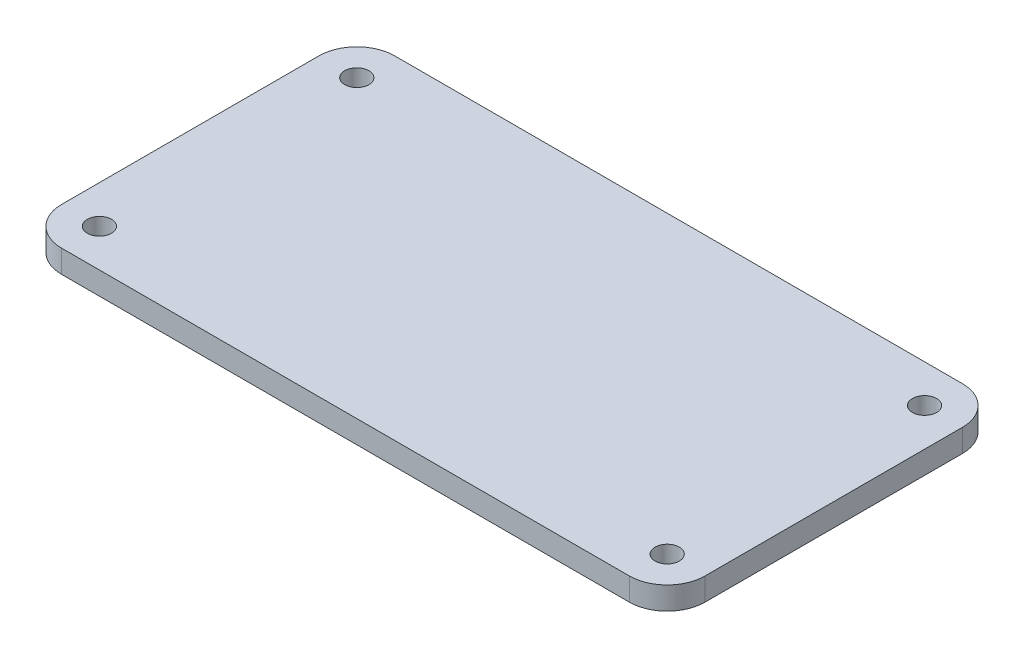
ISO-10303-21;
HEADER;
FILE_DESCRIPTION(('STEP AP214'),'2;1');
FILE_NAME('part.step','',(''),(''),'','','');
FILE_SCHEMA(('AUTOMOTIVE_DESIGN { 1 0 10303 214 1 1 1 1 }'));
ENDSEC;
DATA;
#1=APPLICATION_CONTEXT('core data for automotive mechanical design processes');
#2=APPLICATION_PROTOCOL_DEFINITION('international standard','automotive_design',2000,#1);
#3=PRODUCT_CONTEXT('',#1,'mechanical');
#4=PRODUCT('Part','Part','',(#3));
#5=PRODUCT_RELATED_PRODUCT_CATEGORY('part','',(#4));
#6=PRODUCT_DEFINITION_FORMATION('','',#4);
#7=PRODUCT_DEFINITION_CONTEXT('part definition',#1,'design');
#8=PRODUCT_DEFINITION('design','',#6,#7);
#9=PRODUCT_DEFINITION_SHAPE('','',#8);
#10=(LENGTH_UNIT() NAMED_UNIT(*) SI_UNIT(.MILLI.,.METRE.));
#11=(NAMED_UNIT(*) PLANE_ANGLE_UNIT() SI_UNIT($,.RADIAN.));
#12=(NAMED_UNIT(*) SI_UNIT($,.STERADIAN.) SOLID_ANGLE_UNIT());
#13=UNCERTAINTY_MEASURE_WITH_UNIT(LENGTH_MEASURE(1.E-05),#10,'distance_accuracy_value','');
#14=(GEOMETRIC_REPRESENTATION_CONTEXT(3) GLOBAL_UNCERTAINTY_ASSIGNED_CONTEXT((#13)) GLOBAL_UNIT_ASSIGNED_CONTEXT((#10,
#11,#12)) REPRESENTATION_CONTEXT('',''));
#15=CARTESIAN_POINT('',(0.,0.,0.));
#16=DIRECTION('',(0.,0.,1.));
#17=DIRECTION('',(1.,0.,0.));
#18=AXIS2_PLACEMENT_3D('',#15,#16,#17);
#19=CARTESIAN_POINT('',(-42.5,3.,22.));
#20=DIRECTION('',(1.,0.,0.));
#21=DIRECTION('',(0.,0.,-1.));
#22=AXIS2_PLACEMENT_3D('',#19,#20,#21);
#23=PLANE('',#22);
#24=DIRECTION('',(0.,0.,1.));
#25=VECTOR('',#24,1.);
#26=CARTESIAN_POINT('',(-42.5,0.,22.));
#27=LINE('',#26,#25);
#28=CARTESIAN_POINT('',(-42.5,0.,-17.));
#29=VERTEX_POINT('',#28);
#30=CARTESIAN_POINT('',(-42.5,0.,17.));
#31=VERTEX_POINT('',#30);
#32=EDGE_CURVE('E186',#29,#31,#27,.T.);
#33=ORIENTED_EDGE('',*,*,#32,.T.);
#34=DIRECTION('',(0.,-1.,0.));
#35=VECTOR('',#34,1.);
#36=CARTESIAN_POINT('',(-42.5,3.,17.));
#37=LINE('',#36,#35);
#38=CARTESIAN_POINT('',(-42.5,3.,17.));
#39=VERTEX_POINT('',#38);
#40=EDGE_CURVE('E11',#31,#39,#37,.F.);
#41=ORIENTED_EDGE('',*,*,#40,.T.);
#42=DIRECTION('',(0.,0.,1.));
#43=VECTOR('',#42,1.);
#44=CARTESIAN_POINT('',(-42.5,3.,22.));
#45=LINE('',#44,#43);
#46=CARTESIAN_POINT('',(-42.5,3.,-17.));
#47=VERTEX_POINT('',#46);
#48=EDGE_CURVE('E139',#47,#39,#45,.T.);
#49=ORIENTED_EDGE('',*,*,#48,.F.);
#50=DIRECTION('',(0.,-1.,0.));
#51=VECTOR('',#50,1.);
#52=CARTESIAN_POINT('',(-42.5,3.,-17.));
#53=LINE('',#52,#51);
#54=EDGE_CURVE('E52',#47,#29,#53,.T.);
#55=ORIENTED_EDGE('',*,*,#54,.T.);
#56=EDGE_LOOP('',(#33,#41,#49,#55));
#57=FACE_BOUND('',#56,.T.);
#58=ADVANCED_FACE('F43',(#57),#23,.F.);
#59=CARTESIAN_POINT('',(42.5,3.,22.));
#60=DIRECTION('',(0.,0.,-1.));
#61=DIRECTION('',(-1.,0.,0.));
#62=AXIS2_PLACEMENT_3D('',#59,#60,#61);
#63=PLANE('',#62);
#64=DIRECTION('',(1.,0.,0.));
#65=VECTOR('',#64,1.);
#66=CARTESIAN_POINT('',(42.5,0.,22.));
#67=LINE('',#66,#65);
#68=CARTESIAN_POINT('',(-37.5,0.,22.));
#69=VERTEX_POINT('',#68);
#70=CARTESIAN_POINT('',(37.5,0.,22.));
#71=VERTEX_POINT('',#70);
#72=EDGE_CURVE('E146',#69,#71,#67,.T.);
#73=ORIENTED_EDGE('',*,*,#72,.T.);
#74=DIRECTION('',(0.,-1.,0.));
#75=VECTOR('',#74,1.);
#76=CARTESIAN_POINT('',(37.5,3.,22.));
#77=LINE('',#76,#75);
#78=CARTESIAN_POINT('',(37.5,3.,22.));
#79=VERTEX_POINT('',#78);
#80=EDGE_CURVE('E59',#71,#79,#77,.F.);
#81=ORIENTED_EDGE('',*,*,#80,.T.);
#82=DIRECTION('',(1.,0.,0.));
#83=VECTOR('',#82,1.);
#84=CARTESIAN_POINT('',(42.5,3.,22.));
#85=LINE('',#84,#83);
#86=CARTESIAN_POINT('',(-37.5,3.,22.));
#87=VERTEX_POINT('',#86);
#88=EDGE_CURVE('E144',#87,#79,#85,.T.);
#89=ORIENTED_EDGE('',*,*,#88,.F.);
#90=DIRECTION('',(0.,-1.,0.));
#91=VECTOR('',#90,1.);
#92=CARTESIAN_POINT('',(-37.5,3.,22.));
#93=LINE('',#92,#91);
#94=EDGE_CURVE('E175',#87,#69,#93,.T.);
#95=ORIENTED_EDGE('',*,*,#94,.T.);
#96=EDGE_LOOP('',(#73,#81,#89,#95));
#97=FACE_BOUND('',#96,.T.);
#98=ADVANCED_FACE('F251',(#97),#63,.F.);
#99=CARTESIAN_POINT('',(42.5,3.,22.));
#100=DIRECTION('',(-1.,0.,0.));
#101=DIRECTION('',(0.,0.,1.));
#102=AXIS2_PLACEMENT_3D('',#99,#100,#101);
#103=PLANE('',#102);
#104=DIRECTION('',(0.,0.,-1.));
#105=VECTOR('',#104,1.);
#106=CARTESIAN_POINT('',(42.5,0.,22.));
#107=LINE('',#106,#105);
#108=CARTESIAN_POINT('',(42.5,0.,17.));
#109=VERTEX_POINT('',#108);
#110=CARTESIAN_POINT('',(42.5,0.,-17.));
#111=VERTEX_POINT('',#110);
#112=EDGE_CURVE('E140',#109,#111,#107,.T.);
#113=ORIENTED_EDGE('',*,*,#112,.T.);
#114=DIRECTION('',(0.,-1.,0.));
#115=VECTOR('',#114,1.);
#116=CARTESIAN_POINT('',(42.5,3.,-17.));
#117=LINE('',#116,#115);
#118=CARTESIAN_POINT('',(42.5,3.,-17.));
#119=VERTEX_POINT('',#118);
#120=EDGE_CURVE('E115',#111,#119,#117,.F.);
#121=ORIENTED_EDGE('',*,*,#120,.T.);
#122=DIRECTION('',(0.,0.,-1.));
#123=VECTOR('',#122,1.);
#124=CARTESIAN_POINT('',(42.5,3.,22.));
#125=LINE('',#124,#123);
#126=CARTESIAN_POINT('',(42.5,3.,17.));
#127=VERTEX_POINT('',#126);
#128=EDGE_CURVE('E202',#127,#119,#125,.T.);
#129=ORIENTED_EDGE('',*,*,#128,.F.);
#130=DIRECTION('',(0.,-1.,0.));
#131=VECTOR('',#130,1.);
#132=CARTESIAN_POINT('',(42.5,3.,17.));
#133=LINE('',#132,#131);
#134=EDGE_CURVE('E121',#127,#109,#133,.T.);
#135=ORIENTED_EDGE('',*,*,#134,.T.);
#136=EDGE_LOOP('',(#113,#121,#129,#135));
#137=FACE_BOUND('',#136,.T.);
#138=ADVANCED_FACE('F248',(#137),#103,.F.);
#139=CARTESIAN_POINT('',(42.5,3.,-22.));
#140=DIRECTION('',(0.,0.,1.));
#141=DIRECTION('',(1.,0.,0.));
#142=AXIS2_PLACEMENT_3D('',#139,#140,#141);
#143=PLANE('',#142);
#144=DIRECTION('',(-1.,0.,0.));
#145=VECTOR('',#144,1.);
#146=CARTESIAN_POINT('',(42.5,3.,-22.));
#147=LINE('',#146,#145);
#148=CARTESIAN_POINT('',(37.5,3.,-22.));
#149=VERTEX_POINT('',#148);
#150=CARTESIAN_POINT('',(-37.5,3.,-22.));
#151=VERTEX_POINT('',#150);
#152=EDGE_CURVE('E131',#149,#151,#147,.T.);
#153=ORIENTED_EDGE('',*,*,#152,.F.);
#154=DIRECTION('',(0.,-1.,0.));
#155=VECTOR('',#154,1.);
#156=CARTESIAN_POINT('',(37.5,3.,-22.));
#157=LINE('',#156,#155);
#158=CARTESIAN_POINT('',(37.5,0.,-22.));
#159=VERTEX_POINT('',#158);
#160=EDGE_CURVE('E114',#149,#159,#157,.T.);
#161=ORIENTED_EDGE('',*,*,#160,.T.);
#162=DIRECTION('',(-1.,0.,0.));
#163=VECTOR('',#162,1.);
#164=CARTESIAN_POINT('',(42.5,0.,-22.));
#165=LINE('',#164,#163);
#166=CARTESIAN_POINT('',(-37.5,0.,-22.));
#167=VERTEX_POINT('',#166);
#168=EDGE_CURVE('E128',#159,#167,#165,.T.);
#169=ORIENTED_EDGE('',*,*,#168,.T.);
#170=DIRECTION('',(0.,-1.,0.));
#171=VECTOR('',#170,1.);
#172=CARTESIAN_POINT('',(-37.5,3.,-22.));
#173=LINE('',#172,#171);
#174=EDGE_CURVE('E134',#167,#151,#173,.F.);
#175=ORIENTED_EDGE('',*,*,#174,.T.);
#176=EDGE_LOOP('',(#153,#161,#169,#175));
#177=FACE_BOUND('',#176,.T.);
#178=ADVANCED_FACE('F127',(#177),#143,.F.);
#179=CARTESIAN_POINT('',(0.,3.,0.));
#180=DIRECTION('',(0.,1.,0.));
#181=DIRECTION('',(0.,0.,1.));
#182=AXIS2_PLACEMENT_3D('',#179,#180,#181);
#183=PLANE('',#182);
#184=CARTESIAN_POINT('',(-37.5,3.,17.));
#185=DIRECTION('',(0.,1.,0.));
#186=DIRECTION('',(0.,0.,1.));
#187=AXIS2_PLACEMENT_3D('',#184,#185,#186);
#188=CIRCLE('',#187,1.6);
#189=CARTESIAN_POINT('',(-37.5,3.,18.6));
#190=VERTEX_POINT('',#189);
#191=EDGE_CURVE('E210',#190,#190,#188,.T.);
#192=ORIENTED_EDGE('',*,*,#191,.F.);
#193=EDGE_LOOP('',(#192));
#194=FACE_BOUND('',#193,.T.);
#195=CARTESIAN_POINT('',(37.5,3.,-17.));
#196=DIRECTION('',(0.,1.,0.));
#197=DIRECTION('',(0.,0.,1.));
#198=AXIS2_PLACEMENT_3D('',#195,#196,#197);
#199=CIRCLE('',#198,1.6);
#200=CARTESIAN_POINT('',(37.5,3.,-15.4));
#201=VERTEX_POINT('',#200);
#202=EDGE_CURVE('E216',#201,#201,#199,.T.);
#203=ORIENTED_EDGE('',*,*,#202,.F.);
#204=EDGE_LOOP('',(#203));
#205=FACE_BOUND('',#204,.T.);
#206=CARTESIAN_POINT('',(37.5,3.,17.));
#207=DIRECTION('',(0.,1.,0.));
#208=DIRECTION('',(0.,0.,1.));
#209=AXIS2_PLACEMENT_3D('',#206,#207,#208);
#210=CIRCLE('',#209,1.6);
#211=CARTESIAN_POINT('',(37.5,3.,18.6));
#212=VERTEX_POINT('',#211);
#213=EDGE_CURVE('E217',#212,#212,#210,.T.);
#214=ORIENTED_EDGE('',*,*,#213,.F.);
#215=EDGE_LOOP('',(#214));
#216=FACE_BOUND('',#215,.T.);
#217=CARTESIAN_POINT('',(-37.5,3.,-17.));
#218=DIRECTION('',(0.,1.,0.));
#219=DIRECTION('',(0.,0.,1.));
#220=AXIS2_PLACEMENT_3D('',#217,#218,#219);
#221=CIRCLE('',#220,1.6);
#222=CARTESIAN_POINT('',(-37.5,3.,-15.4));
#223=VERTEX_POINT('',#222);
#224=EDGE_CURVE('E197',#223,#223,#221,.T.);
#225=ORIENTED_EDGE('',*,*,#224,.F.);
#226=EDGE_LOOP('',(#225));
#227=FACE_BOUND('',#226,.T.);
#228=ORIENTED_EDGE('',*,*,#128,.T.);
#229=CARTESIAN_POINT('',(37.5,3.,-17.));
#230=DIRECTION('',(0.,1.,0.));
#231=DIRECTION('',(0.,0.,1.));
#232=AXIS2_PLACEMENT_3D('',#229,#230,#231);
#233=CIRCLE('',#232,5.);
#234=EDGE_CURVE('E172',#119,#149,#233,.T.);
#235=ORIENTED_EDGE('',*,*,#234,.T.);
#236=ORIENTED_EDGE('',*,*,#152,.T.);
#237=CARTESIAN_POINT('',(-37.5,3.,-17.));
#238=DIRECTION('',(0.,1.,0.));
#239=DIRECTION('',(0.,0.,1.));
#240=AXIS2_PLACEMENT_3D('',#237,#238,#239);
#241=CIRCLE('',#240,5.);
#242=EDGE_CURVE('E164',#151,#47,#241,.T.);
#243=ORIENTED_EDGE('',*,*,#242,.T.);
#244=ORIENTED_EDGE('',*,*,#48,.T.);
#245=CARTESIAN_POINT('',(-37.5,3.,17.));
#246=DIRECTION('',(0.,1.,0.));
#247=DIRECTION('',(0.,0.,1.));
#248=AXIS2_PLACEMENT_3D('',#245,#246,#247);
#249=CIRCLE('',#248,5.);
#250=EDGE_CURVE('E66',#39,#87,#249,.T.);
#251=ORIENTED_EDGE('',*,*,#250,.T.);
#252=ORIENTED_EDGE('',*,*,#88,.T.);
#253=CARTESIAN_POINT('',(37.5,3.,17.));
#254=DIRECTION('',(0.,1.,0.));
#255=DIRECTION('',(0.,0.,1.));
#256=AXIS2_PLACEMENT_3D('',#253,#254,#255);
#257=CIRCLE('',#256,5.);
#258=EDGE_CURVE('E169',#79,#127,#257,.T.);
#259=ORIENTED_EDGE('',*,*,#258,.T.);
#260=EDGE_LOOP('',(#228,#235,#236,#243,#244,#251,#252,#259));
#261=FACE_BOUND('',#260,.T.);
#262=ADVANCED_FACE('F238',(#194,#205,#216,#227,#261),#183,.T.);
#263=CARTESIAN_POINT('',(0.,0.,0.));
#264=DIRECTION('',(0.,1.,0.));
#265=DIRECTION('',(0.,0.,1.));
#266=AXIS2_PLACEMENT_3D('',#263,#264,#265);
#267=PLANE('',#266);
#268=CARTESIAN_POINT('',(-37.5,0.,17.));
#269=DIRECTION('',(0.,1.,0.));
#270=DIRECTION('',(0.,0.,1.));
#271=AXIS2_PLACEMENT_3D('',#268,#269,#270);
#272=CIRCLE('',#271,1.6);
#273=CARTESIAN_POINT('',(-37.5,0.,18.6));
#274=VERTEX_POINT('',#273);
#275=EDGE_CURVE('E221',#274,#274,#272,.T.);
#276=ORIENTED_EDGE('',*,*,#275,.T.);
#277=EDGE_LOOP('',(#276));
#278=FACE_BOUND('',#277,.T.);
#279=CARTESIAN_POINT('',(37.5,0.,-17.));
#280=DIRECTION('',(0.,1.,0.));
#281=DIRECTION('',(0.,0.,1.));
#282=AXIS2_PLACEMENT_3D('',#279,#280,#281);
#283=CIRCLE('',#282,1.6);
#284=CARTESIAN_POINT('',(37.5,0.,-15.4));
#285=VERTEX_POINT('',#284);
#286=EDGE_CURVE('E212',#285,#285,#283,.T.);
#287=ORIENTED_EDGE('',*,*,#286,.T.);
#288=EDGE_LOOP('',(#287));
#289=FACE_BOUND('',#288,.T.);
#290=CARTESIAN_POINT('',(37.5,0.,17.));
#291=DIRECTION('',(0.,1.,0.));
#292=DIRECTION('',(0.,0.,1.));
#293=AXIS2_PLACEMENT_3D('',#290,#291,#292);
#294=CIRCLE('',#293,1.6);
#295=CARTESIAN_POINT('',(37.5,0.,18.6));
#296=VERTEX_POINT('',#295);
#297=EDGE_CURVE('E228',#296,#296,#294,.T.);
#298=ORIENTED_EDGE('',*,*,#297,.T.);
#299=EDGE_LOOP('',(#298));
#300=FACE_BOUND('',#299,.T.);
#301=CARTESIAN_POINT('',(-37.5,0.,-17.));
#302=DIRECTION('',(0.,1.,0.));
#303=DIRECTION('',(0.,0.,1.));
#304=AXIS2_PLACEMENT_3D('',#301,#302,#303);
#305=CIRCLE('',#304,1.6);
#306=CARTESIAN_POINT('',(-37.5,0.,-15.4));
#307=VERTEX_POINT('',#306);
#308=EDGE_CURVE('E192',#307,#307,#305,.T.);
#309=ORIENTED_EDGE('',*,*,#308,.T.);
#310=EDGE_LOOP('',(#309));
#311=FACE_BOUND('',#310,.T.);
#312=ORIENTED_EDGE('',*,*,#168,.F.);
#313=CARTESIAN_POINT('',(37.5,0.,-17.));
#314=DIRECTION('',(0.,1.,0.));
#315=DIRECTION('',(0.,0.,1.));
#316=AXIS2_PLACEMENT_3D('',#313,#314,#315);
#317=CIRCLE('',#316,5.);
#318=EDGE_CURVE('E110',#159,#111,#317,.F.);
#319=ORIENTED_EDGE('',*,*,#318,.T.);
#320=ORIENTED_EDGE('',*,*,#112,.F.);
#321=CARTESIAN_POINT('',(37.5,0.,17.));
#322=DIRECTION('',(0.,1.,0.));
#323=DIRECTION('',(0.,0.,1.));
#324=AXIS2_PLACEMENT_3D('',#321,#322,#323);
#325=CIRCLE('',#324,5.);
#326=EDGE_CURVE('E122',#109,#71,#325,.F.);
#327=ORIENTED_EDGE('',*,*,#326,.T.);
#328=ORIENTED_EDGE('',*,*,#72,.F.);
#329=CARTESIAN_POINT('',(-37.5,0.,17.));
#330=DIRECTION('',(0.,1.,0.));
#331=DIRECTION('',(0.,0.,1.));
#332=AXIS2_PLACEMENT_3D('',#329,#330,#331);
#333=CIRCLE('',#332,5.);
#334=EDGE_CURVE('E154',#69,#31,#333,.F.);
#335=ORIENTED_EDGE('',*,*,#334,.T.);
#336=ORIENTED_EDGE('',*,*,#32,.F.);
#337=CARTESIAN_POINT('',(-37.5,0.,-17.));
#338=DIRECTION('',(0.,1.,0.));
#339=DIRECTION('',(0.,0.,1.));
#340=AXIS2_PLACEMENT_3D('',#337,#338,#339);
#341=CIRCLE('',#340,5.);
#342=EDGE_CURVE('E133',#29,#167,#341,.F.);
#343=ORIENTED_EDGE('',*,*,#342,.T.);
#344=EDGE_LOOP('',(#312,#319,#320,#327,#328,#335,#336,#343));
#345=FACE_BOUND('',#344,.T.);
#346=ADVANCED_FACE('F136',(#278,#289,#300,#311,#345),#267,.F.);
#347=CARTESIAN_POINT('',(-37.5,0.,-17.));
#348=DIRECTION('',(0.,1.,0.));
#349=DIRECTION('',(0.,0.,1.));
#350=AXIS2_PLACEMENT_3D('',#347,#348,#349);
#351=CYLINDRICAL_SURFACE('',#350,1.6);
#352=ORIENTED_EDGE('',*,*,#308,.F.);
#353=EDGE_LOOP('',(#352));
#354=FACE_BOUND('',#353,.T.);
#355=ORIENTED_EDGE('',*,*,#224,.T.);
#356=EDGE_LOOP('',(#355));
#357=FACE_BOUND('',#356,.T.);
#358=ADVANCED_FACE('F324',(#354,#357),#351,.F.);
#359=CARTESIAN_POINT('',(37.5,0.,17.));
#360=DIRECTION('',(0.,1.,0.));
#361=DIRECTION('',(0.,0.,1.));
#362=AXIS2_PLACEMENT_3D('',#359,#360,#361);
#363=CYLINDRICAL_SURFACE('',#362,1.6);
#364=ORIENTED_EDGE('',*,*,#297,.F.);
#365=EDGE_LOOP('',(#364));
#366=FACE_BOUND('',#365,.T.);
#367=ORIENTED_EDGE('',*,*,#213,.T.);
#368=EDGE_LOOP('',(#367));
#369=FACE_BOUND('',#368,.T.);
#370=ADVANCED_FACE('F236',(#366,#369),#363,.F.);
#371=CARTESIAN_POINT('',(37.5,0.,-17.));
#372=DIRECTION('',(0.,1.,0.));
#373=DIRECTION('',(0.,0.,1.));
#374=AXIS2_PLACEMENT_3D('',#371,#372,#373);
#375=CYLINDRICAL_SURFACE('',#374,1.6);
#376=ORIENTED_EDGE('',*,*,#286,.F.);
#377=EDGE_LOOP('',(#376));
#378=FACE_BOUND('',#377,.T.);
#379=ORIENTED_EDGE('',*,*,#202,.T.);
#380=EDGE_LOOP('',(#379));
#381=FACE_BOUND('',#380,.T.);
#382=ADVANCED_FACE('F305',(#378,#381),#375,.F.);
#383=CARTESIAN_POINT('',(-37.5,0.,17.));
#384=DIRECTION('',(0.,1.,0.));
#385=DIRECTION('',(0.,0.,1.));
#386=AXIS2_PLACEMENT_3D('',#383,#384,#385);
#387=CYLINDRICAL_SURFACE('',#386,1.6);
#388=ORIENTED_EDGE('',*,*,#275,.F.);
#389=EDGE_LOOP('',(#388));
#390=FACE_BOUND('',#389,.T.);
#391=ORIENTED_EDGE('',*,*,#191,.T.);
#392=EDGE_LOOP('',(#391));
#393=FACE_BOUND('',#392,.T.);
#394=ADVANCED_FACE('F269',(#390,#393),#387,.F.);
#395=CARTESIAN_POINT('',(37.5,3.,-17.));
#396=DIRECTION('',(0.,-1.,0.));
#397=DIRECTION('',(0.,0.,-1.));
#398=AXIS2_PLACEMENT_3D('',#395,#396,#397);
#399=CYLINDRICAL_SURFACE('',#398,5.);
#400=ORIENTED_EDGE('',*,*,#234,.F.);
#401=ORIENTED_EDGE('',*,*,#120,.F.);
#402=ORIENTED_EDGE('',*,*,#318,.F.);
#403=ORIENTED_EDGE('',*,*,#160,.F.);
#404=EDGE_LOOP('',(#400,#401,#402,#403));
#405=FACE_BOUND('',#404,.T.);
#406=ADVANCED_FACE('F113',(#405),#399,.T.);
#407=CARTESIAN_POINT('',(37.5,3.,17.));
#408=DIRECTION('',(0.,-1.,0.));
#409=DIRECTION('',(0.,0.,-1.));
#410=AXIS2_PLACEMENT_3D('',#407,#408,#409);
#411=CYLINDRICAL_SURFACE('',#410,5.);
#412=ORIENTED_EDGE('',*,*,#258,.F.);
#413=ORIENTED_EDGE('',*,*,#80,.F.);
#414=ORIENTED_EDGE('',*,*,#326,.F.);
#415=ORIENTED_EDGE('',*,*,#134,.F.);
#416=EDGE_LOOP('',(#412,#413,#414,#415));
#417=FACE_BOUND('',#416,.T.);
#418=ADVANCED_FACE('F250',(#417),#411,.T.);
#419=CARTESIAN_POINT('',(-37.5,3.,17.));
#420=DIRECTION('',(0.,-1.,0.));
#421=DIRECTION('',(0.,0.,-1.));
#422=AXIS2_PLACEMENT_3D('',#419,#420,#421);
#423=CYLINDRICAL_SURFACE('',#422,5.);
#424=ORIENTED_EDGE('',*,*,#250,.F.);
#425=ORIENTED_EDGE('',*,*,#40,.F.);
#426=ORIENTED_EDGE('',*,*,#334,.F.);
#427=ORIENTED_EDGE('',*,*,#94,.F.);
#428=EDGE_LOOP('',(#424,#425,#426,#427));
#429=FACE_BOUND('',#428,.T.);
#430=ADVANCED_FACE('F254',(#429),#423,.T.);
#431=CARTESIAN_POINT('',(-37.5,3.,-17.));
#432=DIRECTION('',(0.,-1.,0.));
#433=DIRECTION('',(0.,0.,-1.));
#434=AXIS2_PLACEMENT_3D('',#431,#432,#433);
#435=CYLINDRICAL_SURFACE('',#434,5.);
#436=ORIENTED_EDGE('',*,*,#242,.F.);
#437=ORIENTED_EDGE('',*,*,#174,.F.);
#438=ORIENTED_EDGE('',*,*,#342,.F.);
#439=ORIENTED_EDGE('',*,*,#54,.F.);
#440=EDGE_LOOP('',(#436,#437,#438,#439));
#441=FACE_BOUND('',#440,.T.);
#442=ADVANCED_FACE('F45',(#441),#435,.T.);
#443=CLOSED_SHELL('',(#58,#98,#138,#178,#262,#346,#358,#370,#382,#394,#406,#418,#430,#442));
#444=MANIFOLD_SOLID_BREP('B2',#443);
#445=ADVANCED_BREP_SHAPE_REPRESENTATION('',(#18,#444),#14);
#446=SHAPE_DEFINITION_REPRESENTATION(#9,#445);
ENDSEC;
END-ISO-10303-21;
